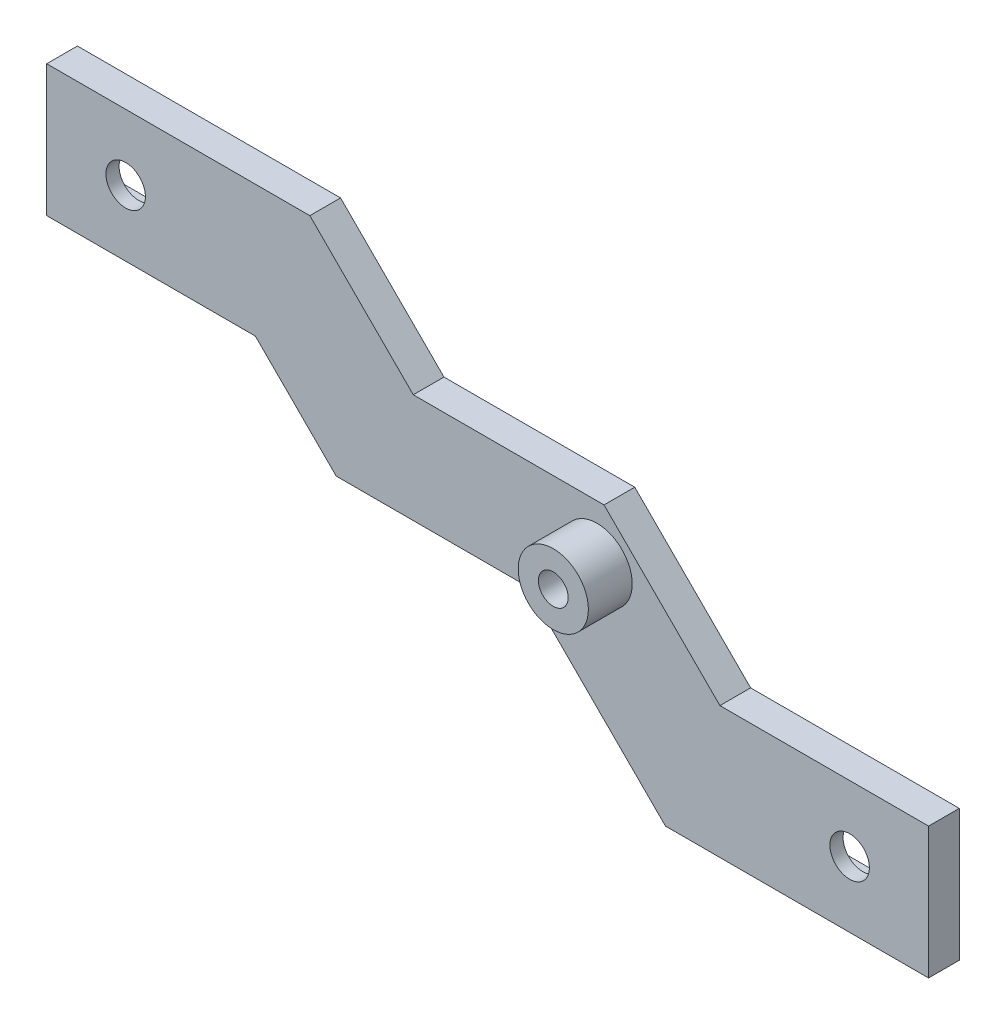
ISO-10303-21;
HEADER;
FILE_DESCRIPTION(('STEP AP214'),'2;1');
FILE_NAME('part.step','',(''),(''),'','','');
FILE_SCHEMA(('AUTOMOTIVE_DESIGN { 1 0 10303 214 1 1 1 1 }'));
ENDSEC;
DATA;
#1=APPLICATION_CONTEXT('core data for automotive mechanical design processes');
#2=APPLICATION_PROTOCOL_DEFINITION('international standard','automotive_design',2000,#1);
#3=PRODUCT_CONTEXT('',#1,'mechanical');
#4=PRODUCT('Part','Part','',(#3));
#5=PRODUCT_RELATED_PRODUCT_CATEGORY('part','',(#4));
#6=PRODUCT_DEFINITION_FORMATION('','',#4);
#7=PRODUCT_DEFINITION_CONTEXT('part definition',#1,'design');
#8=PRODUCT_DEFINITION('design','',#6,#7);
#9=PRODUCT_DEFINITION_SHAPE('','',#8);
#10=(LENGTH_UNIT() NAMED_UNIT(*) SI_UNIT(.MILLI.,.METRE.));
#11=(NAMED_UNIT(*) PLANE_ANGLE_UNIT() SI_UNIT($,.RADIAN.));
#12=(NAMED_UNIT(*) SI_UNIT($,.STERADIAN.) SOLID_ANGLE_UNIT());
#13=UNCERTAINTY_MEASURE_WITH_UNIT(LENGTH_MEASURE(1.E-05),#10,'distance_accuracy_value','');
#14=(GEOMETRIC_REPRESENTATION_CONTEXT(3) GLOBAL_UNCERTAINTY_ASSIGNED_CONTEXT((#13)) GLOBAL_UNIT_ASSIGNED_CONTEXT((#10,
#11,#12)) REPRESENTATION_CONTEXT('',''));
#15=CARTESIAN_POINT('',(0.,0.,0.));
#16=DIRECTION('',(0.,0.,1.));
#17=DIRECTION('',(1.,0.,0.));
#18=AXIS2_PLACEMENT_3D('',#15,#16,#17);
#19=CARTESIAN_POINT('',(0.,0.,0.));
#20=DIRECTION('',(0.,0.,1.));
#21=DIRECTION('',(1.,0.,0.));
#22=AXIS2_PLACEMENT_3D('',#19,#20,#21);
#23=PLANE('',#22);
#24=CARTESIAN_POINT('',(74.9828186778667,14.5000000000001,0.));
#25=DIRECTION('',(0.,0.,1.));
#26=DIRECTION('',(1.,0.,0.));
#27=AXIS2_PLACEMENT_3D('',#24,#25,#26);
#28=CIRCLE('',#27,1.7);
#29=CARTESIAN_POINT('',(76.6828186778667,14.5000000000001,0.));
#30=VERTEX_POINT('',#29);
#31=EDGE_CURVE('E695',#30,#30,#28,.T.);
#32=ORIENTED_EDGE('',*,*,#31,.T.);
#33=EDGE_LOOP('',(#32));
#34=FACE_BOUND('',#33,.T.);
#35=DIRECTION('',(0.,1.,0.));
#36=VECTOR('',#35,1.);
#37=CARTESIAN_POINT('',(32.7303847577293,21.5,0.));
#38=LINE('',#37,#36);
#39=CARTESIAN_POINT('',(32.7303847577293,21.5,0.));
#40=VERTEX_POINT('',#39);
#41=CARTESIAN_POINT('',(32.7303847577293,28.5,0.));
#42=VERTEX_POINT('',#41);
#43=EDGE_CURVE('E307',#40,#42,#38,.T.);
#44=ORIENTED_EDGE('',*,*,#43,.T.);
#45=DIRECTION('',(-1.,0.,0.));
#46=VECTOR('',#45,1.);
#47=CARTESIAN_POINT('',(32.7303847577293,28.5,0.));
#48=LINE('',#47,#46);
#49=CARTESIAN_POINT('',(15.7303847577293,28.5,0.));
#50=VERTEX_POINT('',#49);
#51=EDGE_CURVE('E324',#42,#50,#48,.T.);
#52=ORIENTED_EDGE('',*,*,#51,.T.);
#53=DIRECTION('',(0.,-1.,0.));
#54=VECTOR('',#53,1.);
#55=CARTESIAN_POINT('',(15.7303847577293,21.5,0.));
#56=LINE('',#55,#54);
#57=CARTESIAN_POINT('',(15.7303847577293,21.5,0.));
#58=VERTEX_POINT('',#57);
#59=EDGE_CURVE('E327',#50,#58,#56,.T.);
#60=ORIENTED_EDGE('',*,*,#59,.T.);
#61=DIRECTION('',(1.,0.,0.));
#62=VECTOR('',#61,1.);
#63=CARTESIAN_POINT('',(32.7303847577293,21.5,0.));
#64=LINE('',#63,#62);
#65=EDGE_CURVE('E312',#58,#40,#64,.T.);
#66=ORIENTED_EDGE('',*,*,#65,.T.);
#67=EDGE_LOOP('',(#44,#52,#60,#66));
#68=FACE_BOUND('',#67,.T.);
#69=DIRECTION('',(0.,1.,0.));
#70=VECTOR('',#69,1.);
#71=CARTESIAN_POINT('',(109.269615242271,-3.49999999999999,0.));
#72=LINE('',#71,#70);
#73=CARTESIAN_POINT('',(109.269615242271,-3.49999999999999,0.));
#74=VERTEX_POINT('',#73);
#75=CARTESIAN_POINT('',(109.269615242271,3.5,0.));
#76=VERTEX_POINT('',#75);
#77=EDGE_CURVE('E273',#74,#76,#72,.T.);
#78=ORIENTED_EDGE('',*,*,#77,.T.);
#79=DIRECTION('',(-1.,0.,0.));
#80=VECTOR('',#79,1.);
#81=CARTESIAN_POINT('',(109.269615242271,3.5,0.));
#82=LINE('',#81,#80);
#83=CARTESIAN_POINT('',(92.2696152422706,3.5,0.));
#84=VERTEX_POINT('',#83);
#85=EDGE_CURVE('E290',#76,#84,#82,.T.);
#86=ORIENTED_EDGE('',*,*,#85,.T.);
#87=DIRECTION('',(0.,-1.,0.));
#88=VECTOR('',#87,1.);
#89=CARTESIAN_POINT('',(92.2696152422706,-3.5,0.));
#90=LINE('',#89,#88);
#91=CARTESIAN_POINT('',(92.2696152422706,-3.5,0.));
#92=VERTEX_POINT('',#91);
#93=EDGE_CURVE('E293',#84,#92,#90,.T.);
#94=ORIENTED_EDGE('',*,*,#93,.T.);
#95=DIRECTION('',(1.,0.,0.));
#96=VECTOR('',#95,1.);
#97=CARTESIAN_POINT('',(109.269615242271,-3.49999999999999,0.));
#98=LINE('',#97,#96);
#99=EDGE_CURVE('E278',#92,#74,#98,.T.);
#100=ORIENTED_EDGE('',*,*,#99,.T.);
#101=EDGE_LOOP('',(#78,#86,#94,#100));
#102=FACE_BOUND('',#101,.T.);
#103=DIRECTION('',(-0.707106781186552,0.707106781186543,0.));
#104=VECTOR('',#103,1.);
#105=CARTESIAN_POINT('',(37.3651923788644,37.3651923788649,0.));
#106=LINE('',#105,#104);
#107=CARTESIAN_POINT('',(54.0203847577294,20.7100000000001,0.));
#108=VERTEX_POINT('',#107);
#109=CARTESIAN_POINT('',(42.2303847577293,32.5,0.));
#110=VERTEX_POINT('',#109);
#111=EDGE_CURVE('E250',#108,#110,#106,.T.);
#112=ORIENTED_EDGE('',*,*,#111,.F.);
#113=DIRECTION('',(-1.,0.,0.));
#114=VECTOR('',#113,1.);
#115=CARTESIAN_POINT('',(0.,20.7100000000001,0.));
#116=LINE('',#115,#114);
#117=CARTESIAN_POINT('',(75.7696152422707,20.7100000000001,0.));
#118=VERTEX_POINT('',#117);
#119=EDGE_CURVE('E248',#118,#108,#116,.T.);
#120=ORIENTED_EDGE('',*,*,#119,.F.);
#121=DIRECTION('',(-0.707106781186546,0.707106781186549,0.));
#122=VECTOR('',#121,1.);
#123=CARTESIAN_POINT('',(48.2398076211355,48.2398076211353,0.));
#124=LINE('',#123,#122);
#125=CARTESIAN_POINT('',(88.9796152422707,7.50000000000003,0.));
#126=VERTEX_POINT('',#125);
#127=EDGE_CURVE('E246',#126,#118,#124,.T.);
#128=ORIENTED_EDGE('',*,*,#127,.F.);
#129=DIRECTION('',(-1.,0.,0.));
#130=VECTOR('',#129,1.);
#131=CARTESIAN_POINT('',(0.,7.50000000000003,0.));
#132=LINE('',#131,#130);
#133=CARTESIAN_POINT('',(112.769615242271,7.50000000000003,0.));
#134=VERTEX_POINT('',#133);
#135=EDGE_CURVE('E244',#134,#126,#132,.T.);
#136=ORIENTED_EDGE('',*,*,#135,.F.);
#137=DIRECTION('',(0.,1.,0.));
#138=VECTOR('',#137,1.);
#139=CARTESIAN_POINT('',(112.769615242271,-7.49999999999999,0.));
#140=LINE('',#139,#138);
#141=CARTESIAN_POINT('',(112.769615242271,-7.49999999999999,0.));
#142=VERTEX_POINT('',#141);
#143=EDGE_CURVE('E341',#142,#134,#140,.T.);
#144=ORIENTED_EDGE('',*,*,#143,.F.);
#145=DIRECTION('',(1.,0.,0.));
#146=VECTOR('',#145,1.);
#147=CARTESIAN_POINT('',(112.769615242271,-7.49999999999999,0.));
#148=LINE('',#147,#146);
#149=CARTESIAN_POINT('',(82.7696152422706,-7.5,0.));
#150=VERTEX_POINT('',#149);
#151=EDGE_CURVE('E349',#150,#142,#148,.T.);
#152=ORIENTED_EDGE('',*,*,#151,.F.);
#153=DIRECTION('',(0.707106781186552,-0.707106781186543,0.));
#154=VECTOR('',#153,1.);
#155=CARTESIAN_POINT('',(37.6348076211348,37.6348076211353,0.));
#156=LINE('',#155,#154);
#157=CARTESIAN_POINT('',(66.9828186778667,8.28679656440374,0.));
#158=VERTEX_POINT('',#157);
#159=EDGE_CURVE('E242',#158,#150,#156,.T.);
#160=ORIENTED_EDGE('',*,*,#159,.F.);
#161=DIRECTION('',(1.,0.,0.));
#162=VECTOR('',#161,1.);
#163=CARTESIAN_POINT('',(0.,8.28679656440372,0.));
#164=LINE('',#163,#162);
#165=CARTESIAN_POINT('',(45.2303847577293,8.28679656440373,0.));
#166=VERTEX_POINT('',#165);
#167=EDGE_CURVE('E240',#166,#158,#164,.T.);
#168=ORIENTED_EDGE('',*,*,#167,.F.);
#169=DIRECTION('',(0.707106781186552,-0.707106781186543,0.));
#170=VECTOR('',#169,1.);
#171=CARTESIAN_POINT('',(26.7585906610663,26.7585906610666,0.));
#172=LINE('',#171,#170);
#173=CARTESIAN_POINT('',(36.0171813221329,17.5,0.));
#174=VERTEX_POINT('',#173);
#175=EDGE_CURVE('E184',#174,#166,#172,.T.);
#176=ORIENTED_EDGE('',*,*,#175,.F.);
#177=DIRECTION('',(1.,0.,0.));
#178=VECTOR('',#177,1.);
#179=CARTESIAN_POINT('',(0.,17.5,0.));
#180=LINE('',#179,#178);
#181=CARTESIAN_POINT('',(12.2303847577293,17.5,0.));
#182=VERTEX_POINT('',#181);
#183=EDGE_CURVE('E222',#182,#174,#180,.T.);
#184=ORIENTED_EDGE('',*,*,#183,.F.);
#185=DIRECTION('',(0.,-1.,0.));
#186=VECTOR('',#185,1.);
#187=CARTESIAN_POINT('',(12.2303847577293,-7.50000000000001,0.));
#188=LINE('',#187,#186);
#189=CARTESIAN_POINT('',(12.2303847577293,32.5,0.));
#190=VERTEX_POINT('',#189);
#191=EDGE_CURVE('E346',#190,#182,#188,.T.);
#192=ORIENTED_EDGE('',*,*,#191,.F.);
#193=DIRECTION('',(-1.,0.,0.));
#194=VECTOR('',#193,1.);
#195=CARTESIAN_POINT('',(112.769615242271,32.5,0.));
#196=LINE('',#195,#194);
#197=EDGE_CURVE('E344',#110,#190,#196,.T.);
#198=ORIENTED_EDGE('',*,*,#197,.F.);
#199=EDGE_LOOP('',(#112,#120,#128,#136,#144,#152,#160,#168,#176,#184,#192,#198));
#200=FACE_BOUND('',#199,.T.);
#201=ADVANCED_FACE('F43',(#34,#68,#102,#200),#23,.F.);
#202=CARTESIAN_POINT('',(112.769615242271,-7.49999999999999,2.));
#203=DIRECTION('',(-1.,0.,0.));
#204=DIRECTION('',(0.,0.,1.));
#205=AXIS2_PLACEMENT_3D('',#202,#203,#204);
#206=PLANE('',#205);
#207=DIRECTION('',(0.,0.,1.));
#208=VECTOR('',#207,1.);
#209=CARTESIAN_POINT('',(112.769615242271,7.50000000000003,-28.));
#210=LINE('',#209,#208);
#211=CARTESIAN_POINT('',(112.769615242271,7.50000000000003,3.5));
#212=VERTEX_POINT('',#211);
#213=EDGE_CURVE('E229',#134,#212,#210,.T.);
#214=ORIENTED_EDGE('',*,*,#213,.T.);
#215=DIRECTION('',(0.,1.,0.));
#216=VECTOR('',#215,1.);
#217=CARTESIAN_POINT('',(112.769615242271,32.5,3.5));
#218=LINE('',#217,#216);
#219=CARTESIAN_POINT('',(112.769615242271,-7.49999999999999,3.5));
#220=VERTEX_POINT('',#219);
#221=EDGE_CURVE('E268',#220,#212,#218,.T.);
#222=ORIENTED_EDGE('',*,*,#221,.F.);
#223=DIRECTION('',(0.,0.,-1.));
#224=VECTOR('',#223,1.);
#225=CARTESIAN_POINT('',(112.769615242271,-7.49999999999999,2.));
#226=LINE('',#225,#224);
#227=EDGE_CURVE('E51',#220,#142,#226,.T.);
#228=ORIENTED_EDGE('',*,*,#227,.T.);
#229=ORIENTED_EDGE('',*,*,#143,.T.);
#230=EDGE_LOOP('',(#214,#222,#228,#229));
#231=FACE_BOUND('',#230,.T.);
#232=ADVANCED_FACE('F45',(#231),#206,.F.);
#233=CARTESIAN_POINT('',(112.769615242271,32.5,2.));
#234=DIRECTION('',(0.,-1.,0.));
#235=DIRECTION('',(1.,0.,0.));
#236=AXIS2_PLACEMENT_3D('',#233,#234,#235);
#237=PLANE('',#236);
#238=DIRECTION('',(0.,0.,1.));
#239=VECTOR('',#238,1.);
#240=CARTESIAN_POINT('',(42.2303847577293,32.5,-28.));
#241=LINE('',#240,#239);
#242=CARTESIAN_POINT('',(42.2303847577293,32.5,3.5));
#243=VERTEX_POINT('',#242);
#244=EDGE_CURVE('E220',#110,#243,#241,.T.);
#245=ORIENTED_EDGE('',*,*,#244,.F.);
#246=ORIENTED_EDGE('',*,*,#197,.T.);
#247=DIRECTION('',(0.,0.,-1.));
#248=VECTOR('',#247,1.);
#249=CARTESIAN_POINT('',(12.2303847577293,32.5,2.));
#250=LINE('',#249,#248);
#251=CARTESIAN_POINT('',(12.2303847577293,32.5,3.5));
#252=VERTEX_POINT('',#251);
#253=EDGE_CURVE('E11',#252,#190,#250,.T.);
#254=ORIENTED_EDGE('',*,*,#253,.F.);
#255=DIRECTION('',(-1.,0.,0.));
#256=VECTOR('',#255,1.);
#257=CARTESIAN_POINT('',(12.2303847577293,32.5,3.5));
#258=LINE('',#257,#256);
#259=EDGE_CURVE('E271',#243,#252,#258,.T.);
#260=ORIENTED_EDGE('',*,*,#259,.F.);
#261=EDGE_LOOP('',(#245,#246,#254,#260));
#262=FACE_BOUND('',#261,.T.);
#263=ADVANCED_FACE('F380',(#262),#237,.F.);
#264=CARTESIAN_POINT('',(12.2303847577293,-7.50000000000001,2.));
#265=DIRECTION('',(1.,0.,0.));
#266=DIRECTION('',(0.,0.,-1.));
#267=AXIS2_PLACEMENT_3D('',#264,#265,#266);
#268=PLANE('',#267);
#269=DIRECTION('',(0.,0.,1.));
#270=VECTOR('',#269,1.);
#271=CARTESIAN_POINT('',(12.2303847577293,17.5,-28.));
#272=LINE('',#271,#270);
#273=CARTESIAN_POINT('',(12.2303847577293,17.5,3.5));
#274=VERTEX_POINT('',#273);
#275=EDGE_CURVE('E219',#182,#274,#272,.T.);
#276=ORIENTED_EDGE('',*,*,#275,.T.);
#277=DIRECTION('',(0.,-1.,0.));
#278=VECTOR('',#277,1.);
#279=CARTESIAN_POINT('',(12.2303847577293,32.5,3.5));
#280=LINE('',#279,#278);
#281=EDGE_CURVE('E262',#252,#274,#280,.T.);
#282=ORIENTED_EDGE('',*,*,#281,.F.);
#283=ORIENTED_EDGE('',*,*,#253,.T.);
#284=ORIENTED_EDGE('',*,*,#191,.T.);
#285=EDGE_LOOP('',(#276,#282,#283,#284));
#286=FACE_BOUND('',#285,.T.);
#287=ADVANCED_FACE('F390',(#286),#268,.F.);
#288=CARTESIAN_POINT('',(112.769615242271,-7.49999999999999,2.));
#289=DIRECTION('',(0.,1.,0.));
#290=DIRECTION('',(-1.,0.,0.));
#291=AXIS2_PLACEMENT_3D('',#288,#289,#290);
#292=PLANE('',#291);
#293=DIRECTION('',(0.,0.,1.));
#294=VECTOR('',#293,1.);
#295=CARTESIAN_POINT('',(82.7696152422706,-7.5,-28.));
#296=LINE('',#295,#294);
#297=CARTESIAN_POINT('',(82.7696152422706,-7.5,3.5));
#298=VERTEX_POINT('',#297);
#299=EDGE_CURVE('E232',#150,#298,#296,.T.);
#300=ORIENTED_EDGE('',*,*,#299,.F.);
#301=ORIENTED_EDGE('',*,*,#151,.T.);
#302=ORIENTED_EDGE('',*,*,#227,.F.);
#303=DIRECTION('',(1.,0.,0.));
#304=VECTOR('',#303,1.);
#305=CARTESIAN_POINT('',(12.2303847577293,-7.49999999999999,3.5));
#306=LINE('',#305,#304);
#307=EDGE_CURVE('E266',#298,#220,#306,.T.);
#308=ORIENTED_EDGE('',*,*,#307,.F.);
#309=EDGE_LOOP('',(#300,#301,#302,#308));
#310=FACE_BOUND('',#309,.T.);
#311=ADVANCED_FACE('F384',(#310),#292,.F.);
#312=CARTESIAN_POINT('',(0.,0.,3.5));
#313=DIRECTION('',(0.,0.,1.));
#314=DIRECTION('',(1.,0.,0.));
#315=AXIS2_PLACEMENT_3D('',#312,#313,#314);
#316=PLANE('',#315);
#317=CARTESIAN_POINT('',(74.9828186778667,14.5000000000001,3.5));
#318=DIRECTION('',(0.,0.,1.));
#319=DIRECTION('',(1.,0.,0.));
#320=AXIS2_PLACEMENT_3D('',#317,#318,#319);
#321=CIRCLE('',#320,4.00000000000001);
#322=CARTESIAN_POINT('',(78.9828186778667,14.5000000000001,3.5));
#323=VERTEX_POINT('',#322);
#324=EDGE_CURVE('E696',#323,#323,#321,.T.);
#325=ORIENTED_EDGE('',*,*,#324,.F.);
#326=EDGE_LOOP('',(#325));
#327=FACE_BOUND('',#326,.T.);
#328=CARTESIAN_POINT('',(21.2303847577281,25.,3.5));
#329=DIRECTION('',(0.,0.,1.));
#330=DIRECTION('',(1.,0.,0.));
#331=AXIS2_PLACEMENT_3D('',#328,#329,#330);
#332=CIRCLE('',#331,2.25);
#333=CARTESIAN_POINT('',(23.4803847577281,25.,3.5));
#334=VERTEX_POINT('',#333);
#335=EDGE_CURVE('E259',#334,#334,#332,.T.);
#336=ORIENTED_EDGE('',*,*,#335,.F.);
#337=EDGE_LOOP('',(#336));
#338=FACE_BOUND('',#337,.T.);
#339=CARTESIAN_POINT('',(103.769615242269,3.67761376907083E-13,3.5));
#340=DIRECTION('',(0.,0.,1.));
#341=DIRECTION('',(1.,0.,0.));
#342=AXIS2_PLACEMENT_3D('',#339,#340,#341);
#343=CIRCLE('',#342,2.25);
#344=CARTESIAN_POINT('',(106.019615242269,3.67761376907083E-13,3.5));
#345=VERTEX_POINT('',#344);
#346=EDGE_CURVE('E253',#345,#345,#343,.T.);
#347=ORIENTED_EDGE('',*,*,#346,.F.);
#348=EDGE_LOOP('',(#347));
#349=FACE_BOUND('',#348,.T.);
#350=DIRECTION('',(-1.,0.,0.));
#351=VECTOR('',#350,1.);
#352=CARTESIAN_POINT('',(54.0203847577294,20.7100000000001,3.5));
#353=LINE('',#352,#351);
#354=CARTESIAN_POINT('',(75.7696152422707,20.7100000000001,3.5));
#355=VERTEX_POINT('',#354);
#356=CARTESIAN_POINT('',(54.0203847577294,20.7100000000001,3.5));
#357=VERTEX_POINT('',#356);
#358=EDGE_CURVE('E214',#355,#357,#353,.T.);
#359=ORIENTED_EDGE('',*,*,#358,.T.);
#360=DIRECTION('',(-0.707106781186552,0.707106781186543,0.));
#361=VECTOR('',#360,1.);
#362=CARTESIAN_POINT('',(42.2303847577293,32.5,3.5));
#363=LINE('',#362,#361);
#364=EDGE_CURVE('E216',#357,#243,#363,.T.);
#365=ORIENTED_EDGE('',*,*,#364,.T.);
#366=ORIENTED_EDGE('',*,*,#259,.T.);
#367=ORIENTED_EDGE('',*,*,#281,.T.);
#368=DIRECTION('',(1.,0.,0.));
#369=VECTOR('',#368,1.);
#370=CARTESIAN_POINT('',(36.0171813221329,17.5,3.5));
#371=LINE('',#370,#369);
#372=CARTESIAN_POINT('',(36.0171813221329,17.5,3.5));
#373=VERTEX_POINT('',#372);
#374=EDGE_CURVE('E203',#274,#373,#371,.T.);
#375=ORIENTED_EDGE('',*,*,#374,.T.);
#376=DIRECTION('',(0.707106781186552,-0.707106781186543,0.));
#377=VECTOR('',#376,1.);
#378=CARTESIAN_POINT('',(45.2303847577293,8.28679656440373,3.5));
#379=LINE('',#378,#377);
#380=CARTESIAN_POINT('',(45.2303847577293,8.28679656440373,3.5));
#381=VERTEX_POINT('',#380);
#382=EDGE_CURVE('E66',#373,#381,#379,.T.);
#383=ORIENTED_EDGE('',*,*,#382,.T.);
#384=DIRECTION('',(1.,0.,0.));
#385=VECTOR('',#384,1.);
#386=CARTESIAN_POINT('',(66.9828186778667,8.28679656440374,3.5));
#387=LINE('',#386,#385);
#388=CARTESIAN_POINT('',(66.9828186778667,8.28679656440374,3.5));
#389=VERTEX_POINT('',#388);
#390=EDGE_CURVE('E191',#381,#389,#387,.T.);
#391=ORIENTED_EDGE('',*,*,#390,.T.);
#392=DIRECTION('',(0.707106781186552,-0.707106781186543,0.));
#393=VECTOR('',#392,1.);
#394=CARTESIAN_POINT('',(82.7696152422706,-7.5,3.5));
#395=LINE('',#394,#393);
#396=EDGE_CURVE('E197',#389,#298,#395,.T.);
#397=ORIENTED_EDGE('',*,*,#396,.T.);
#398=ORIENTED_EDGE('',*,*,#307,.T.);
#399=ORIENTED_EDGE('',*,*,#221,.T.);
#400=DIRECTION('',(-1.,0.,0.));
#401=VECTOR('',#400,1.);
#402=CARTESIAN_POINT('',(88.9796152422707,7.50000000000003,3.5));
#403=LINE('',#402,#401);
#404=CARTESIAN_POINT('',(88.9796152422707,7.50000000000003,3.5));
#405=VERTEX_POINT('',#404);
#406=EDGE_CURVE('E210',#212,#405,#403,.T.);
#407=ORIENTED_EDGE('',*,*,#406,.T.);
#408=DIRECTION('',(-0.707106781186546,0.707106781186549,0.));
#409=VECTOR('',#408,1.);
#410=CARTESIAN_POINT('',(75.7696152422707,20.7100000000001,3.5));
#411=LINE('',#410,#409);
#412=EDGE_CURVE('E58',#405,#355,#411,.T.);
#413=ORIENTED_EDGE('',*,*,#412,.T.);
#414=EDGE_LOOP('',(#359,#365,#366,#367,#375,#383,#391,#397,#398,#399,#407,#413));
#415=FACE_BOUND('',#414,.T.);
#416=ADVANCED_FACE('F201',(#327,#338,#349,#415),#316,.T.);
#417=CARTESIAN_POINT('',(32.7303847577293,21.5,2.));
#418=DIRECTION('',(-1.,0.,0.));
#419=DIRECTION('',(0.,0.,1.));
#420=AXIS2_PLACEMENT_3D('',#417,#418,#419);
#421=PLANE('',#420);
#422=ORIENTED_EDGE('',*,*,#43,.F.);
#423=DIRECTION('',(0.,0.,-1.));
#424=VECTOR('',#423,1.);
#425=CARTESIAN_POINT('',(32.7303847577293,21.5,2.));
#426=LINE('',#425,#424);
#427=CARTESIAN_POINT('',(32.7303847577293,21.5,2.));
#428=VERTEX_POINT('',#427);
#429=EDGE_CURVE('E321',#428,#40,#426,.T.);
#430=ORIENTED_EDGE('',*,*,#429,.F.);
#431=DIRECTION('',(0.,1.,0.));
#432=VECTOR('',#431,1.);
#433=CARTESIAN_POINT('',(32.7303847577293,21.5,2.));
#434=LINE('',#433,#432);
#435=CARTESIAN_POINT('',(32.7303847577293,28.5,2.));
#436=VERTEX_POINT('',#435);
#437=EDGE_CURVE('E308',#428,#436,#434,.T.);
#438=ORIENTED_EDGE('',*,*,#437,.T.);
#439=DIRECTION('',(0.,0.,-1.));
#440=VECTOR('',#439,1.);
#441=CARTESIAN_POINT('',(32.7303847577293,28.5,2.));
#442=LINE('',#441,#440);
#443=EDGE_CURVE('E338',#436,#42,#442,.T.);
#444=ORIENTED_EDGE('',*,*,#443,.T.);
#445=EDGE_LOOP('',(#422,#430,#438,#444));
#446=FACE_BOUND('',#445,.T.);
#447=ADVANCED_FACE('F416',(#446),#421,.T.);
#448=CARTESIAN_POINT('',(32.7303847577293,28.5,2.));
#449=DIRECTION('',(0.,-1.,0.));
#450=DIRECTION('',(0.,0.,-1.));
#451=AXIS2_PLACEMENT_3D('',#448,#449,#450);
#452=PLANE('',#451);
#453=ORIENTED_EDGE('',*,*,#51,.F.);
#454=ORIENTED_EDGE('',*,*,#443,.F.);
#455=DIRECTION('',(-1.,0.,0.));
#456=VECTOR('',#455,1.);
#457=CARTESIAN_POINT('',(32.7303847577293,28.5,2.));
#458=LINE('',#457,#456);
#459=CARTESIAN_POINT('',(15.7303847577293,28.5,2.));
#460=VERTEX_POINT('',#459);
#461=EDGE_CURVE('E311',#436,#460,#458,.T.);
#462=ORIENTED_EDGE('',*,*,#461,.T.);
#463=DIRECTION('',(0.,0.,-1.));
#464=VECTOR('',#463,1.);
#465=CARTESIAN_POINT('',(15.7303847577293,28.5,2.));
#466=LINE('',#465,#464);
#467=EDGE_CURVE('E336',#460,#50,#466,.T.);
#468=ORIENTED_EDGE('',*,*,#467,.T.);
#469=EDGE_LOOP('',(#453,#454,#462,#468));
#470=FACE_BOUND('',#469,.T.);
#471=ADVANCED_FACE('F528',(#470),#452,.T.);
#472=CARTESIAN_POINT('',(15.7303847577293,21.5,2.));
#473=DIRECTION('',(1.,0.,0.));
#474=DIRECTION('',(0.,0.,-1.));
#475=AXIS2_PLACEMENT_3D('',#472,#473,#474);
#476=PLANE('',#475);
#477=ORIENTED_EDGE('',*,*,#59,.F.);
#478=ORIENTED_EDGE('',*,*,#467,.F.);
#479=DIRECTION('',(0.,-1.,0.));
#480=VECTOR('',#479,1.);
#481=CARTESIAN_POINT('',(15.7303847577293,21.5,2.));
#482=LINE('',#481,#480);
#483=CARTESIAN_POINT('',(15.7303847577293,21.5,2.));
#484=VERTEX_POINT('',#483);
#485=EDGE_CURVE('E315',#460,#484,#482,.T.);
#486=ORIENTED_EDGE('',*,*,#485,.T.);
#487=DIRECTION('',(0.,0.,-1.));
#488=VECTOR('',#487,1.);
#489=CARTESIAN_POINT('',(15.7303847577293,21.5,2.));
#490=LINE('',#489,#488);
#491=EDGE_CURVE('E334',#484,#58,#490,.T.);
#492=ORIENTED_EDGE('',*,*,#491,.T.);
#493=EDGE_LOOP('',(#477,#478,#486,#492));
#494=FACE_BOUND('',#493,.T.);
#495=ADVANCED_FACE('F519',(#494),#476,.T.);
#496=CARTESIAN_POINT('',(32.7303847577293,21.5,2.));
#497=DIRECTION('',(0.,1.,0.));
#498=DIRECTION('',(-1.,0.,0.));
#499=AXIS2_PLACEMENT_3D('',#496,#497,#498);
#500=PLANE('',#499);
#501=ORIENTED_EDGE('',*,*,#65,.F.);
#502=ORIENTED_EDGE('',*,*,#491,.F.);
#503=DIRECTION('',(1.,0.,0.));
#504=VECTOR('',#503,1.);
#505=CARTESIAN_POINT('',(32.7303847577293,21.5,2.));
#506=LINE('',#505,#504);
#507=EDGE_CURVE('E318',#484,#428,#506,.T.);
#508=ORIENTED_EDGE('',*,*,#507,.T.);
#509=ORIENTED_EDGE('',*,*,#429,.T.);
#510=EDGE_LOOP('',(#501,#502,#508,#509));
#511=FACE_BOUND('',#510,.T.);
#512=ADVANCED_FACE('F510',(#511),#500,.T.);
#513=CARTESIAN_POINT('',(109.269615242271,-3.49999999999999,2.));
#514=DIRECTION('',(-1.,0.,0.));
#515=DIRECTION('',(0.,0.,1.));
#516=AXIS2_PLACEMENT_3D('',#513,#514,#515);
#517=PLANE('',#516);
#518=ORIENTED_EDGE('',*,*,#77,.F.);
#519=DIRECTION('',(0.,0.,-1.));
#520=VECTOR('',#519,1.);
#521=CARTESIAN_POINT('',(109.269615242271,-3.49999999999999,2.));
#522=LINE('',#521,#520);
#523=CARTESIAN_POINT('',(109.269615242271,-3.49999999999999,2.));
#524=VERTEX_POINT('',#523);
#525=EDGE_CURVE('E287',#524,#74,#522,.T.);
#526=ORIENTED_EDGE('',*,*,#525,.F.);
#527=DIRECTION('',(0.,1.,0.));
#528=VECTOR('',#527,1.);
#529=CARTESIAN_POINT('',(109.269615242271,-3.49999999999999,2.));
#530=LINE('',#529,#528);
#531=CARTESIAN_POINT('',(109.269615242271,3.5,2.));
#532=VERTEX_POINT('',#531);
#533=EDGE_CURVE('E274',#524,#532,#530,.T.);
#534=ORIENTED_EDGE('',*,*,#533,.T.);
#535=DIRECTION('',(0.,0.,-1.));
#536=VECTOR('',#535,1.);
#537=CARTESIAN_POINT('',(109.269615242271,3.5,2.));
#538=LINE('',#537,#536);
#539=EDGE_CURVE('E304',#532,#76,#538,.T.);
#540=ORIENTED_EDGE('',*,*,#539,.T.);
#541=EDGE_LOOP('',(#518,#526,#534,#540));
#542=FACE_BOUND('',#541,.T.);
#543=ADVANCED_FACE('F501',(#542),#517,.T.);
#544=CARTESIAN_POINT('',(109.269615242271,3.5,2.));
#545=DIRECTION('',(0.,-1.,0.));
#546=DIRECTION('',(0.,0.,-1.));
#547=AXIS2_PLACEMENT_3D('',#544,#545,#546);
#548=PLANE('',#547);
#549=ORIENTED_EDGE('',*,*,#85,.F.);
#550=ORIENTED_EDGE('',*,*,#539,.F.);
#551=DIRECTION('',(-1.,0.,0.));
#552=VECTOR('',#551,1.);
#553=CARTESIAN_POINT('',(109.269615242271,3.5,2.));
#554=LINE('',#553,#552);
#555=CARTESIAN_POINT('',(92.2696152422706,3.5,2.));
#556=VERTEX_POINT('',#555);
#557=EDGE_CURVE('E277',#532,#556,#554,.T.);
#558=ORIENTED_EDGE('',*,*,#557,.T.);
#559=DIRECTION('',(0.,0.,-1.));
#560=VECTOR('',#559,1.);
#561=CARTESIAN_POINT('',(92.2696152422706,3.5,2.));
#562=LINE('',#561,#560);
#563=EDGE_CURVE('E302',#556,#84,#562,.T.);
#564=ORIENTED_EDGE('',*,*,#563,.T.);
#565=EDGE_LOOP('',(#549,#550,#558,#564));
#566=FACE_BOUND('',#565,.T.);
#567=ADVANCED_FACE('F492',(#566),#548,.T.);
#568=CARTESIAN_POINT('',(92.2696152422706,-3.5,2.));
#569=DIRECTION('',(1.,0.,0.));
#570=DIRECTION('',(0.,0.,-1.));
#571=AXIS2_PLACEMENT_3D('',#568,#569,#570);
#572=PLANE('',#571);
#573=ORIENTED_EDGE('',*,*,#93,.F.);
#574=ORIENTED_EDGE('',*,*,#563,.F.);
#575=DIRECTION('',(0.,-1.,0.));
#576=VECTOR('',#575,1.);
#577=CARTESIAN_POINT('',(92.2696152422706,-3.5,2.));
#578=LINE('',#577,#576);
#579=CARTESIAN_POINT('',(92.2696152422706,-3.5,2.));
#580=VERTEX_POINT('',#579);
#581=EDGE_CURVE('E281',#556,#580,#578,.T.);
#582=ORIENTED_EDGE('',*,*,#581,.T.);
#583=DIRECTION('',(0.,0.,-1.));
#584=VECTOR('',#583,1.);
#585=CARTESIAN_POINT('',(92.2696152422706,-3.5,2.));
#586=LINE('',#585,#584);
#587=EDGE_CURVE('E300',#580,#92,#586,.T.);
#588=ORIENTED_EDGE('',*,*,#587,.T.);
#589=EDGE_LOOP('',(#573,#574,#582,#588));
#590=FACE_BOUND('',#589,.T.);
#591=ADVANCED_FACE('F483',(#590),#572,.T.);
#592=CARTESIAN_POINT('',(109.269615242271,-3.49999999999999,2.));
#593=DIRECTION('',(0.,1.,0.));
#594=DIRECTION('',(-1.,0.,0.));
#595=AXIS2_PLACEMENT_3D('',#592,#593,#594);
#596=PLANE('',#595);
#597=ORIENTED_EDGE('',*,*,#99,.F.);
#598=ORIENTED_EDGE('',*,*,#587,.F.);
#599=DIRECTION('',(1.,0.,0.));
#600=VECTOR('',#599,1.);
#601=CARTESIAN_POINT('',(109.269615242271,-3.49999999999999,2.));
#602=LINE('',#601,#600);
#603=EDGE_CURVE('E284',#580,#524,#602,.T.);
#604=ORIENTED_EDGE('',*,*,#603,.T.);
#605=ORIENTED_EDGE('',*,*,#525,.T.);
#606=EDGE_LOOP('',(#597,#598,#604,#605));
#607=FACE_BOUND('',#606,.T.);
#608=ADVANCED_FACE('F475',(#607),#596,.T.);
#609=CARTESIAN_POINT('',(0.,0.,2.));
#610=DIRECTION('',(0.,0.,1.));
#611=DIRECTION('',(1.,0.,0.));
#612=AXIS2_PLACEMENT_3D('',#609,#610,#611);
#613=PLANE('',#612);
#614=ORIENTED_EDGE('',*,*,#461,.F.);
#615=ORIENTED_EDGE('',*,*,#437,.F.);
#616=ORIENTED_EDGE('',*,*,#507,.F.);
#617=ORIENTED_EDGE('',*,*,#485,.F.);
#618=EDGE_LOOP('',(#614,#615,#616,#617));
#619=FACE_BOUND('',#618,.T.);
#620=CARTESIAN_POINT('',(21.2303847577281,25.,2.));
#621=DIRECTION('',(0.,0.,1.));
#622=DIRECTION('',(1.,0.,0.));
#623=AXIS2_PLACEMENT_3D('',#620,#621,#622);
#624=CIRCLE('',#623,2.25);
#625=CARTESIAN_POINT('',(23.4803847577281,25.,2.));
#626=VERTEX_POINT('',#625);
#627=EDGE_CURVE('E256',#626,#626,#624,.T.);
#628=ORIENTED_EDGE('',*,*,#627,.T.);
#629=EDGE_LOOP('',(#628));
#630=FACE_BOUND('',#629,.T.);
#631=ADVANCED_FACE('F466',(#619,#630),#613,.F.);
#632=ORIENTED_EDGE('',*,*,#557,.F.);
#633=ORIENTED_EDGE('',*,*,#533,.F.);
#634=ORIENTED_EDGE('',*,*,#603,.F.);
#635=ORIENTED_EDGE('',*,*,#581,.F.);
#636=EDGE_LOOP('',(#632,#633,#634,#635));
#637=FACE_BOUND('',#636,.T.);
#638=CARTESIAN_POINT('',(103.769615242269,3.67761376907083E-13,2.));
#639=DIRECTION('',(0.,0.,1.));
#640=DIRECTION('',(1.,0.,0.));
#641=AXIS2_PLACEMENT_3D('',#638,#639,#640);
#642=CIRCLE('',#641,2.25);
#643=CARTESIAN_POINT('',(106.019615242269,3.67761376907083E-13,2.));
#644=VERTEX_POINT('',#643);
#645=EDGE_CURVE('E252',#644,#644,#642,.T.);
#646=ORIENTED_EDGE('',*,*,#645,.T.);
#647=EDGE_LOOP('',(#646));
#648=FACE_BOUND('',#647,.T.);
#649=ADVANCED_FACE('F457',(#637,#648),#613,.F.);
#650=CARTESIAN_POINT('',(21.2303847577281,25.,3.5));
#651=DIRECTION('',(0.,0.,-1.));
#652=DIRECTION('',(-1.,0.,0.));
#653=AXIS2_PLACEMENT_3D('',#650,#651,#652);
#654=CYLINDRICAL_SURFACE('',#653,2.25);
#655=ORIENTED_EDGE('',*,*,#335,.T.);
#656=EDGE_LOOP('',(#655));
#657=FACE_BOUND('',#656,.T.);
#658=ORIENTED_EDGE('',*,*,#627,.F.);
#659=EDGE_LOOP('',(#658));
#660=FACE_BOUND('',#659,.T.);
#661=ADVANCED_FACE('F401',(#657,#660),#654,.F.);
#662=CARTESIAN_POINT('',(103.769615242269,3.67761376907083E-13,3.5));
#663=DIRECTION('',(0.,0.,-1.));
#664=DIRECTION('',(-1.,0.,0.));
#665=AXIS2_PLACEMENT_3D('',#662,#663,#664);
#666=CYLINDRICAL_SURFACE('',#665,2.25);
#667=ORIENTED_EDGE('',*,*,#346,.T.);
#668=EDGE_LOOP('',(#667));
#669=FACE_BOUND('',#668,.T.);
#670=ORIENTED_EDGE('',*,*,#645,.F.);
#671=EDGE_LOOP('',(#670));
#672=FACE_BOUND('',#671,.T.);
#673=ADVANCED_FACE('F393',(#669,#672),#666,.F.);
#674=CARTESIAN_POINT('',(36.0171813221329,17.5,-28.));
#675=DIRECTION('',(0.,-1.,0.));
#676=DIRECTION('',(1.,0.,0.));
#677=AXIS2_PLACEMENT_3D('',#674,#675,#676);
#678=PLANE('',#677);
#679=ORIENTED_EDGE('',*,*,#183,.T.);
#680=DIRECTION('',(0.,0.,1.));
#681=VECTOR('',#680,1.);
#682=CARTESIAN_POINT('',(36.0171813221329,17.5,-28.));
#683=LINE('',#682,#681);
#684=EDGE_CURVE('E188',#174,#373,#683,.T.);
#685=ORIENTED_EDGE('',*,*,#684,.T.);
#686=ORIENTED_EDGE('',*,*,#374,.F.);
#687=ORIENTED_EDGE('',*,*,#275,.F.);
#688=EDGE_LOOP('',(#679,#685,#686,#687));
#689=FACE_BOUND('',#688,.T.);
#690=ADVANCED_FACE('F391',(#689),#678,.T.);
#691=CARTESIAN_POINT('',(45.2303847577293,8.28679656440373,-28.));
#692=DIRECTION('',(-0.707106781186543,-0.707106781186552,0.));
#693=DIRECTION('',(0.707106781186552,-0.707106781186543,0.));
#694=AXIS2_PLACEMENT_3D('',#691,#692,#693);
#695=PLANE('',#694);
#696=ORIENTED_EDGE('',*,*,#175,.T.);
#697=DIRECTION('',(0.,0.,1.));
#698=VECTOR('',#697,1.);
#699=CARTESIAN_POINT('',(45.2303847577293,8.28679656440373,-28.));
#700=LINE('',#699,#698);
#701=EDGE_CURVE('E180',#166,#381,#700,.T.);
#702=ORIENTED_EDGE('',*,*,#701,.T.);
#703=ORIENTED_EDGE('',*,*,#382,.F.);
#704=ORIENTED_EDGE('',*,*,#684,.F.);
#705=EDGE_LOOP('',(#696,#702,#703,#704));
#706=FACE_BOUND('',#705,.T.);
#707=ADVANCED_FACE('F182',(#706),#695,.T.);
#708=CARTESIAN_POINT('',(66.9828186778667,8.28679656440374,-28.));
#709=DIRECTION('',(0.,-1.,0.));
#710=DIRECTION('',(1.,0.,0.));
#711=AXIS2_PLACEMENT_3D('',#708,#709,#710);
#712=PLANE('',#711);
#713=ORIENTED_EDGE('',*,*,#167,.T.);
#714=DIRECTION('',(0.,0.,1.));
#715=VECTOR('',#714,1.);
#716=CARTESIAN_POINT('',(66.9828186778667,8.28679656440374,-28.));
#717=LINE('',#716,#715);
#718=EDGE_CURVE('E187',#158,#389,#717,.T.);
#719=ORIENTED_EDGE('',*,*,#718,.T.);
#720=ORIENTED_EDGE('',*,*,#390,.F.);
#721=ORIENTED_EDGE('',*,*,#701,.F.);
#722=EDGE_LOOP('',(#713,#719,#720,#721));
#723=FACE_BOUND('',#722,.T.);
#724=ADVANCED_FACE('F192',(#723),#712,.T.);
#725=CARTESIAN_POINT('',(82.7696152422706,-7.5,-28.));
#726=DIRECTION('',(-0.707106781186543,-0.707106781186552,0.));
#727=DIRECTION('',(0.707106781186552,-0.707106781186543,0.));
#728=AXIS2_PLACEMENT_3D('',#725,#726,#727);
#729=PLANE('',#728);
#730=ORIENTED_EDGE('',*,*,#159,.T.);
#731=ORIENTED_EDGE('',*,*,#299,.T.);
#732=ORIENTED_EDGE('',*,*,#396,.F.);
#733=ORIENTED_EDGE('',*,*,#718,.F.);
#734=EDGE_LOOP('',(#730,#731,#732,#733));
#735=FACE_BOUND('',#734,.T.);
#736=ADVANCED_FACE('F386',(#735),#729,.T.);
#737=CARTESIAN_POINT('',(42.2303847577293,32.5,-28.));
#738=DIRECTION('',(0.707106781186543,0.707106781186552,0.));
#739=DIRECTION('',(-0.707106781186552,0.707106781186543,0.));
#740=AXIS2_PLACEMENT_3D('',#737,#738,#739);
#741=PLANE('',#740);
#742=ORIENTED_EDGE('',*,*,#111,.T.);
#743=ORIENTED_EDGE('',*,*,#244,.T.);
#744=ORIENTED_EDGE('',*,*,#364,.F.);
#745=DIRECTION('',(0.,0.,1.));
#746=VECTOR('',#745,1.);
#747=CARTESIAN_POINT('',(54.0203847577294,20.7100000000001,-28.));
#748=LINE('',#747,#746);
#749=EDGE_CURVE('E223',#108,#357,#748,.T.);
#750=ORIENTED_EDGE('',*,*,#749,.F.);
#751=EDGE_LOOP('',(#742,#743,#744,#750));
#752=FACE_BOUND('',#751,.T.);
#753=ADVANCED_FACE('F376',(#752),#741,.T.);
#754=CARTESIAN_POINT('',(54.0203847577294,20.7100000000001,-28.));
#755=DIRECTION('',(0.,1.,0.));
#756=DIRECTION('',(0.,0.,1.));
#757=AXIS2_PLACEMENT_3D('',#754,#755,#756);
#758=PLANE('',#757);
#759=ORIENTED_EDGE('',*,*,#119,.T.);
#760=ORIENTED_EDGE('',*,*,#749,.T.);
#761=ORIENTED_EDGE('',*,*,#358,.F.);
#762=DIRECTION('',(0.,0.,1.));
#763=VECTOR('',#762,1.);
#764=CARTESIAN_POINT('',(75.7696152422707,20.7100000000001,-28.));
#765=LINE('',#764,#763);
#766=EDGE_CURVE('E225',#118,#355,#765,.T.);
#767=ORIENTED_EDGE('',*,*,#766,.F.);
#768=EDGE_LOOP('',(#759,#760,#761,#767));
#769=FACE_BOUND('',#768,.T.);
#770=ADVANCED_FACE('F370',(#769),#758,.T.);
#771=CARTESIAN_POINT('',(75.7696152422707,20.7100000000001,-28.));
#772=DIRECTION('',(0.707106781186549,0.707106781186546,0.));
#773=DIRECTION('',(-0.707106781186546,0.707106781186549,0.));
#774=AXIS2_PLACEMENT_3D('',#771,#772,#773);
#775=PLANE('',#774);
#776=ORIENTED_EDGE('',*,*,#127,.T.);
#777=ORIENTED_EDGE('',*,*,#766,.T.);
#778=ORIENTED_EDGE('',*,*,#412,.F.);
#779=DIRECTION('',(0.,0.,1.));
#780=VECTOR('',#779,1.);
#781=CARTESIAN_POINT('',(88.9796152422707,7.50000000000003,-28.));
#782=LINE('',#781,#780);
#783=EDGE_CURVE('E227',#126,#405,#782,.T.);
#784=ORIENTED_EDGE('',*,*,#783,.F.);
#785=EDGE_LOOP('',(#776,#777,#778,#784));
#786=FACE_BOUND('',#785,.T.);
#787=ADVANCED_FACE('F366',(#786),#775,.T.);
#788=CARTESIAN_POINT('',(88.9796152422707,7.50000000000003,-28.));
#789=DIRECTION('',(0.,1.,0.));
#790=DIRECTION('',(-1.,0.,0.));
#791=AXIS2_PLACEMENT_3D('',#788,#789,#790);
#792=PLANE('',#791);
#793=ORIENTED_EDGE('',*,*,#135,.T.);
#794=ORIENTED_EDGE('',*,*,#783,.T.);
#795=ORIENTED_EDGE('',*,*,#406,.F.);
#796=ORIENTED_EDGE('',*,*,#213,.F.);
#797=EDGE_LOOP('',(#793,#794,#795,#796));
#798=FACE_BOUND('',#797,.T.);
#799=ADVANCED_FACE('F365',(#798),#792,.T.);
#800=CARTESIAN_POINT('',(74.9828186778667,14.5000000000001,8.5));
#801=DIRECTION('',(0.,0.,-1.));
#802=DIRECTION('',(-1.,0.,0.));
#803=AXIS2_PLACEMENT_3D('',#800,#801,#802);
#804=CYLINDRICAL_SURFACE('',#803,4.00000000000001);
#805=CARTESIAN_POINT('',(74.9828186778667,14.5000000000001,8.5));
#806=DIRECTION('',(0.,0.,1.));
#807=DIRECTION('',(1.,0.,0.));
#808=AXIS2_PLACEMENT_3D('',#805,#806,#807);
#809=CIRCLE('',#808,4.00000000000001);
#810=CARTESIAN_POINT('',(78.9828186778667,14.5000000000001,8.5));
#811=VERTEX_POINT('',#810);
#812=EDGE_CURVE('E205',#811,#811,#809,.T.);
#813=ORIENTED_EDGE('',*,*,#812,.F.);
#814=EDGE_LOOP('',(#813));
#815=FACE_BOUND('',#814,.T.);
#816=ORIENTED_EDGE('',*,*,#324,.T.);
#817=EDGE_LOOP('',(#816));
#818=FACE_BOUND('',#817,.T.);
#819=ADVANCED_FACE('F588',(#815,#818),#804,.T.);
#820=CARTESIAN_POINT('',(74.9828186778667,14.5000000000001,8.5));
#821=DIRECTION('',(0.,0.,1.));
#822=DIRECTION('',(1.,0.,0.));
#823=AXIS2_PLACEMENT_3D('',#820,#821,#822);
#824=PLANE('',#823);
#825=CARTESIAN_POINT('',(74.9828186778667,14.5000000000001,8.5));
#826=DIRECTION('',(0.,0.,1.));
#827=DIRECTION('',(1.,0.,0.));
#828=AXIS2_PLACEMENT_3D('',#825,#826,#827);
#829=CIRCLE('',#828,1.7);
#830=CARTESIAN_POINT('',(76.6828186778667,14.5000000000001,8.5));
#831=VERTEX_POINT('',#830);
#832=EDGE_CURVE('E693',#831,#831,#829,.T.);
#833=ORIENTED_EDGE('',*,*,#832,.F.);
#834=EDGE_LOOP('',(#833));
#835=FACE_BOUND('',#834,.T.);
#836=ORIENTED_EDGE('',*,*,#812,.T.);
#837=EDGE_LOOP('',(#836));
#838=FACE_BOUND('',#837,.T.);
#839=ADVANCED_FACE('F591',(#835,#838),#824,.T.);
#840=CARTESIAN_POINT('',(74.9828186778667,14.5000000000001,-1.5));
#841=DIRECTION('',(0.,0.,1.));
#842=DIRECTION('',(1.,0.,0.));
#843=AXIS2_PLACEMENT_3D('',#840,#841,#842);
#844=CYLINDRICAL_SURFACE('',#843,1.7);
#845=ORIENTED_EDGE('',*,*,#832,.T.);
#846=EDGE_LOOP('',(#845));
#847=FACE_BOUND('',#846,.T.);
#848=ORIENTED_EDGE('',*,*,#31,.F.);
#849=EDGE_LOOP('',(#848));
#850=FACE_BOUND('',#849,.T.);
#851=ADVANCED_FACE('F607',(#847,#850),#844,.F.);
#852=CLOSED_SHELL('',(#201,#232,#263,#287,#311,#416,#447,#471,#495,#512,#543,#567,#591,#608,
#631,#649,#661,#673,#690,#707,#724,#736,#753,#770,#787,#799,#819,#839,#851));
#853=MANIFOLD_SOLID_BREP('B2',#852);
#854=ADVANCED_BREP_SHAPE_REPRESENTATION('',(#18,#853),#14);
#855=SHAPE_DEFINITION_REPRESENTATION(#9,#854);
ENDSEC;
END-ISO-10303-21;
